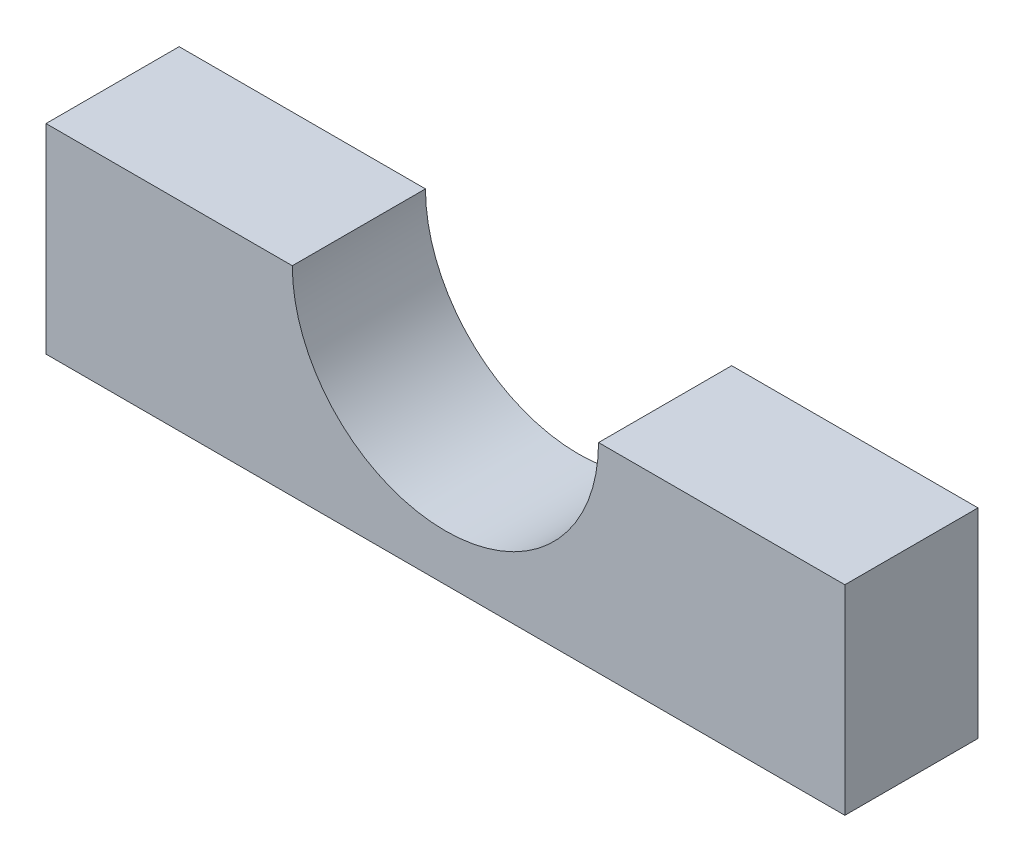
ISO-10303-21;
HEADER;
FILE_DESCRIPTION(('STEP AP214'),'2;1');
FILE_NAME('part.step','',(''),(''),'','','');
FILE_SCHEMA(('AUTOMOTIVE_DESIGN { 1 0 10303 214 1 1 1 1 }'));
ENDSEC;
DATA;
#1=APPLICATION_CONTEXT('core data for automotive mechanical design processes');
#2=APPLICATION_PROTOCOL_DEFINITION('international standard','automotive_design',2000,#1);
#3=PRODUCT_CONTEXT('',#1,'mechanical');
#4=PRODUCT('Part','Part','',(#3));
#5=PRODUCT_RELATED_PRODUCT_CATEGORY('part','',(#4));
#6=PRODUCT_DEFINITION_FORMATION('','',#4);
#7=PRODUCT_DEFINITION_CONTEXT('part definition',#1,'design');
#8=PRODUCT_DEFINITION('design','',#6,#7);
#9=PRODUCT_DEFINITION_SHAPE('','',#8);
#10=(LENGTH_UNIT() NAMED_UNIT(*) SI_UNIT(.MILLI.,.METRE.));
#11=(NAMED_UNIT(*) PLANE_ANGLE_UNIT() SI_UNIT($,.RADIAN.));
#12=(NAMED_UNIT(*) SI_UNIT($,.STERADIAN.) SOLID_ANGLE_UNIT());
#13=UNCERTAINTY_MEASURE_WITH_UNIT(LENGTH_MEASURE(1.E-05),#10,'distance_accuracy_value','');
#14=(GEOMETRIC_REPRESENTATION_CONTEXT(3) GLOBAL_UNCERTAINTY_ASSIGNED_CONTEXT((#13)) GLOBAL_UNIT_ASSIGNED_CONTEXT((#10,
#11,#12)) REPRESENTATION_CONTEXT('',''));
#15=CARTESIAN_POINT('',(0.,0.,0.));
#16=DIRECTION('',(0.,0.,1.));
#17=DIRECTION('',(1.,0.,0.));
#18=AXIS2_PLACEMENT_3D('',#15,#16,#17);
#19=CARTESIAN_POINT('',(0.,0.,12.7));
#20=DIRECTION('',(0.,0.,-1.));
#21=DIRECTION('',(-1.,0.,0.));
#22=AXIS2_PLACEMENT_3D('',#19,#20,#21);
#23=CYLINDRICAL_SURFACE('',#22,14.605);
#24=CARTESIAN_POINT('',(0.,0.,0.));
#25=DIRECTION('',(0.,0.,1.));
#26=DIRECTION('',(1.,0.,0.));
#27=AXIS2_PLACEMENT_3D('',#24,#25,#26);
#28=CIRCLE('',#27,14.605);
#29=CARTESIAN_POINT('',(-14.605,0.,0.));
#30=VERTEX_POINT('',#29);
#31=CARTESIAN_POINT('',(14.605,0.,0.));
#32=VERTEX_POINT('',#31);
#33=EDGE_CURVE('E123',#30,#32,#28,.T.);
#34=ORIENTED_EDGE('',*,*,#33,.F.);
#35=DIRECTION('',(0.,0.,-1.));
#36=VECTOR('',#35,1.);
#37=CARTESIAN_POINT('',(-14.605,0.,12.7));
#38=LINE('',#37,#36);
#39=CARTESIAN_POINT('',(-14.605,0.,12.7));
#40=VERTEX_POINT('',#39);
#41=EDGE_CURVE('E11',#40,#30,#38,.T.);
#42=ORIENTED_EDGE('',*,*,#41,.F.);
#43=CARTESIAN_POINT('',(0.,0.,12.7));
#44=DIRECTION('',(0.,0.,1.));
#45=DIRECTION('',(1.,0.,0.));
#46=AXIS2_PLACEMENT_3D('',#43,#44,#45);
#47=CIRCLE('',#46,14.605);
#48=CARTESIAN_POINT('',(14.605,0.,12.7));
#49=VERTEX_POINT('',#48);
#50=EDGE_CURVE('E135',#40,#49,#47,.T.);
#51=ORIENTED_EDGE('',*,*,#50,.T.);
#52=DIRECTION('',(0.,0.,-1.));
#53=VECTOR('',#52,1.);
#54=CARTESIAN_POINT('',(14.605,0.,12.7));
#55=LINE('',#54,#53);
#56=EDGE_CURVE('E57',#49,#32,#55,.T.);
#57=ORIENTED_EDGE('',*,*,#56,.T.);
#58=EDGE_LOOP('',(#34,#42,#51,#57));
#59=FACE_BOUND('',#58,.T.);
#60=ADVANCED_FACE('F41',(#59),#23,.F.);
#61=CARTESIAN_POINT('',(0.,0.,12.7));
#62=DIRECTION('',(0.,-1.,0.));
#63=DIRECTION('',(1.,0.,0.));
#64=AXIS2_PLACEMENT_3D('',#61,#62,#63);
#65=PLANE('',#64);
#66=DIRECTION('',(-1.,0.,0.));
#67=VECTOR('',#66,1.);
#68=CARTESIAN_POINT('',(0.,0.,0.));
#69=LINE('',#68,#67);
#70=CARTESIAN_POINT('',(-38.1,0.,0.));
#71=VERTEX_POINT('',#70);
#72=EDGE_CURVE('E125',#30,#71,#69,.T.);
#73=ORIENTED_EDGE('',*,*,#72,.T.);
#74=DIRECTION('',(0.,0.,-1.));
#75=VECTOR('',#74,1.);
#76=CARTESIAN_POINT('',(-38.1,0.,12.7));
#77=LINE('',#76,#75);
#78=CARTESIAN_POINT('',(-38.1,0.,12.7));
#79=VERTEX_POINT('',#78);
#80=EDGE_CURVE('E49',#79,#71,#77,.T.);
#81=ORIENTED_EDGE('',*,*,#80,.F.);
#82=DIRECTION('',(-1.,0.,0.));
#83=VECTOR('',#82,1.);
#84=CARTESIAN_POINT('',(0.,0.,12.7));
#85=LINE('',#84,#83);
#86=EDGE_CURVE('E227',#40,#79,#85,.T.);
#87=ORIENTED_EDGE('',*,*,#86,.F.);
#88=ORIENTED_EDGE('',*,*,#41,.T.);
#89=EDGE_LOOP('',(#73,#81,#87,#88));
#90=FACE_BOUND('',#89,.T.);
#91=ADVANCED_FACE('F158',(#90),#65,.F.);
#92=CARTESIAN_POINT('',(-38.1,0.,12.7));
#93=DIRECTION('',(1.,0.,0.));
#94=DIRECTION('',(0.,0.,-1.));
#95=AXIS2_PLACEMENT_3D('',#92,#93,#94);
#96=PLANE('',#95);
#97=DIRECTION('',(0.,-1.,0.));
#98=VECTOR('',#97,1.);
#99=CARTESIAN_POINT('',(-38.1,0.,0.));
#100=LINE('',#99,#98);
#101=CARTESIAN_POINT('',(-38.1,-19.05,0.));
#102=VERTEX_POINT('',#101);
#103=EDGE_CURVE('E127',#71,#102,#100,.T.);
#104=ORIENTED_EDGE('',*,*,#103,.T.);
#105=DIRECTION('',(0.,0.,-1.));
#106=VECTOR('',#105,1.);
#107=CARTESIAN_POINT('',(-38.1,-19.05,12.7));
#108=LINE('',#107,#106);
#109=CARTESIAN_POINT('',(-38.1,-19.05,12.7));
#110=VERTEX_POINT('',#109);
#111=EDGE_CURVE('E115',#110,#102,#108,.T.);
#112=ORIENTED_EDGE('',*,*,#111,.F.);
#113=DIRECTION('',(0.,-1.,0.));
#114=VECTOR('',#113,1.);
#115=CARTESIAN_POINT('',(-38.1,0.,12.7));
#116=LINE('',#115,#114);
#117=EDGE_CURVE('E103',#79,#110,#116,.T.);
#118=ORIENTED_EDGE('',*,*,#117,.F.);
#119=ORIENTED_EDGE('',*,*,#80,.T.);
#120=EDGE_LOOP('',(#104,#112,#118,#119));
#121=FACE_BOUND('',#120,.T.);
#122=ADVANCED_FACE('F142',(#121),#96,.F.);
#123=CARTESIAN_POINT('',(0.,-19.05,12.7));
#124=DIRECTION('',(0.,1.,0.));
#125=DIRECTION('',(-1.,0.,0.));
#126=AXIS2_PLACEMENT_3D('',#123,#124,#125);
#127=PLANE('',#126);
#128=DIRECTION('',(1.,0.,0.));
#129=VECTOR('',#128,1.);
#130=CARTESIAN_POINT('',(0.,-19.05,0.));
#131=LINE('',#130,#129);
#132=CARTESIAN_POINT('',(38.1,-19.05,0.));
#133=VERTEX_POINT('',#132);
#134=EDGE_CURVE('E112',#102,#133,#131,.T.);
#135=ORIENTED_EDGE('',*,*,#134,.T.);
#136=DIRECTION('',(0.,0.,-1.));
#137=VECTOR('',#136,1.);
#138=CARTESIAN_POINT('',(38.1,-19.05,12.7));
#139=LINE('',#138,#137);
#140=CARTESIAN_POINT('',(38.1,-19.05,12.7));
#141=VERTEX_POINT('',#140);
#142=EDGE_CURVE('E109',#141,#133,#139,.T.);
#143=ORIENTED_EDGE('',*,*,#142,.F.);
#144=DIRECTION('',(1.,0.,0.));
#145=VECTOR('',#144,1.);
#146=CARTESIAN_POINT('',(0.,-19.05,12.7));
#147=LINE('',#146,#145);
#148=EDGE_CURVE('E95',#110,#141,#147,.T.);
#149=ORIENTED_EDGE('',*,*,#148,.F.);
#150=ORIENTED_EDGE('',*,*,#111,.T.);
#151=EDGE_LOOP('',(#135,#143,#149,#150));
#152=FACE_BOUND('',#151,.T.);
#153=ADVANCED_FACE('F110',(#152),#127,.F.);
#154=CARTESIAN_POINT('',(38.1,0.,12.7));
#155=DIRECTION('',(1.,0.,0.));
#156=DIRECTION('',(0.,1.,0.));
#157=AXIS2_PLACEMENT_3D('',#154,#155,#156);
#158=PLANE('',#157);
#159=DIRECTION('',(0.,-1.,0.));
#160=VECTOR('',#159,1.);
#161=CARTESIAN_POINT('',(38.1,0.,0.));
#162=LINE('',#161,#160);
#163=CARTESIAN_POINT('',(38.1,0.,0.));
#164=VERTEX_POINT('',#163);
#165=EDGE_CURVE('E130',#164,#133,#162,.T.);
#166=ORIENTED_EDGE('',*,*,#165,.F.);
#167=DIRECTION('',(0.,0.,-1.));
#168=VECTOR('',#167,1.);
#169=CARTESIAN_POINT('',(38.1,0.,12.7));
#170=LINE('',#169,#168);
#171=CARTESIAN_POINT('',(38.1,0.,12.7));
#172=VERTEX_POINT('',#171);
#173=EDGE_CURVE('E76',#172,#164,#170,.T.);
#174=ORIENTED_EDGE('',*,*,#173,.F.);
#175=DIRECTION('',(0.,-1.,0.));
#176=VECTOR('',#175,1.);
#177=CARTESIAN_POINT('',(38.1,0.,12.7));
#178=LINE('',#177,#176);
#179=EDGE_CURVE('E101',#172,#141,#178,.T.);
#180=ORIENTED_EDGE('',*,*,#179,.T.);
#181=ORIENTED_EDGE('',*,*,#142,.T.);
#182=EDGE_LOOP('',(#166,#174,#180,#181));
#183=FACE_BOUND('',#182,.T.);
#184=ADVANCED_FACE('F117',(#183),#158,.T.);
#185=CARTESIAN_POINT('',(0.,0.,12.7));
#186=DIRECTION('',(0.,1.,0.));
#187=DIRECTION('',(-1.,0.,0.));
#188=AXIS2_PLACEMENT_3D('',#185,#186,#187);
#189=PLANE('',#188);
#190=DIRECTION('',(1.,0.,0.));
#191=VECTOR('',#190,1.);
#192=CARTESIAN_POINT('',(0.,0.,0.));
#193=LINE('',#192,#191);
#194=EDGE_CURVE('E132',#32,#164,#193,.T.);
#195=ORIENTED_EDGE('',*,*,#194,.F.);
#196=ORIENTED_EDGE('',*,*,#56,.F.);
#197=DIRECTION('',(1.,0.,0.));
#198=VECTOR('',#197,1.);
#199=CARTESIAN_POINT('',(0.,0.,12.7));
#200=LINE('',#199,#198);
#201=EDGE_CURVE('E118',#49,#172,#200,.T.);
#202=ORIENTED_EDGE('',*,*,#201,.T.);
#203=ORIENTED_EDGE('',*,*,#173,.T.);
#204=EDGE_LOOP('',(#195,#196,#202,#203));
#205=FACE_BOUND('',#204,.T.);
#206=ADVANCED_FACE('F147',(#205),#189,.T.);
#207=CARTESIAN_POINT('',(0.,0.,12.7));
#208=DIRECTION('',(0.,0.,1.));
#209=DIRECTION('',(1.,0.,0.));
#210=AXIS2_PLACEMENT_3D('',#207,#208,#209);
#211=PLANE('',#210);
#212=ORIENTED_EDGE('',*,*,#50,.F.);
#213=ORIENTED_EDGE('',*,*,#86,.T.);
#214=ORIENTED_EDGE('',*,*,#117,.T.);
#215=ORIENTED_EDGE('',*,*,#148,.T.);
#216=ORIENTED_EDGE('',*,*,#179,.F.);
#217=ORIENTED_EDGE('',*,*,#201,.F.);
#218=EDGE_LOOP('',(#212,#213,#214,#215,#216,#217));
#219=FACE_BOUND('',#218,.T.);
#220=ADVANCED_FACE('F98',(#219),#211,.T.);
#221=CARTESIAN_POINT('',(0.,0.,0.));
#222=DIRECTION('',(0.,0.,1.));
#223=DIRECTION('',(1.,0.,0.));
#224=AXIS2_PLACEMENT_3D('',#221,#222,#223);
#225=PLANE('',#224);
#226=ORIENTED_EDGE('',*,*,#33,.T.);
#227=ORIENTED_EDGE('',*,*,#194,.T.);
#228=ORIENTED_EDGE('',*,*,#165,.T.);
#229=ORIENTED_EDGE('',*,*,#134,.F.);
#230=ORIENTED_EDGE('',*,*,#103,.F.);
#231=ORIENTED_EDGE('',*,*,#72,.F.);
#232=EDGE_LOOP('',(#226,#227,#228,#229,#230,#231));
#233=FACE_BOUND('',#232,.T.);
#234=ADVANCED_FACE('F146',(#233),#225,.F.);
#235=CLOSED_SHELL('',(#60,#91,#122,#153,#184,#206,#220,#234));
#236=MANIFOLD_SOLID_BREP('B2',#235);
#237=ADVANCED_BREP_SHAPE_REPRESENTATION('',(#18,#236),#14);
#238=SHAPE_DEFINITION_REPRESENTATION(#9,#237);
ENDSEC;
END-ISO-10303-21;
